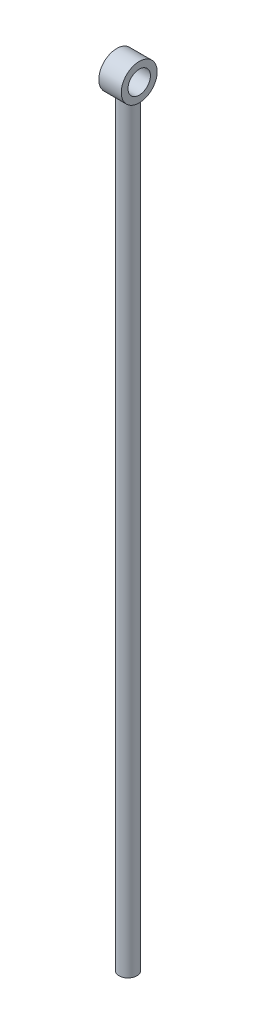
ISO-10303-21;
HEADER;
FILE_DESCRIPTION(('STEP AP214'),'2;1');
FILE_NAME('part.step','',(''),(''),'','','');
FILE_SCHEMA(('AUTOMOTIVE_DESIGN { 1 0 10303 214 1 1 1 1 }'));
ENDSEC;
DATA;
#1=APPLICATION_CONTEXT('core data for automotive mechanical design processes');
#2=APPLICATION_PROTOCOL_DEFINITION('international standard','automotive_design',2000,#1);
#3=PRODUCT_CONTEXT('',#1,'mechanical');
#4=PRODUCT('Part','Part','',(#3));
#5=PRODUCT_RELATED_PRODUCT_CATEGORY('part','',(#4));
#6=PRODUCT_DEFINITION_FORMATION('','',#4);
#7=PRODUCT_DEFINITION_CONTEXT('part definition',#1,'design');
#8=PRODUCT_DEFINITION('design','',#6,#7);
#9=PRODUCT_DEFINITION_SHAPE('','',#8);
#10=(LENGTH_UNIT() NAMED_UNIT(*) SI_UNIT(.MILLI.,.METRE.));
#11=(NAMED_UNIT(*) PLANE_ANGLE_UNIT() SI_UNIT($,.RADIAN.));
#12=(NAMED_UNIT(*) SI_UNIT($,.STERADIAN.) SOLID_ANGLE_UNIT());
#13=UNCERTAINTY_MEASURE_WITH_UNIT(LENGTH_MEASURE(1.E-05),#10,'distance_accuracy_value','');
#14=(GEOMETRIC_REPRESENTATION_CONTEXT(3) GLOBAL_UNCERTAINTY_ASSIGNED_CONTEXT((#13)) GLOBAL_UNIT_ASSIGNED_CONTEXT((#10,
#11,#12)) REPRESENTATION_CONTEXT('',''));
#15=CARTESIAN_POINT('',(0.,0.,0.));
#16=DIRECTION('',(0.,0.,1.));
#17=DIRECTION('',(1.,0.,0.));
#18=AXIS2_PLACEMENT_3D('',#15,#16,#17);
#19=CARTESIAN_POINT('',(3.175,0.,0.));
#20=DIRECTION('',(1.,0.,0.));
#21=DIRECTION('',(0.,0.,-1.));
#22=AXIS2_PLACEMENT_3D('',#19,#20,#21);
#23=PLANE('',#22);
#24=CARTESIAN_POINT('',(3.175,0.,0.));
#25=DIRECTION('',(1.,0.,0.));
#26=DIRECTION('',(0.,0.,-1.));
#27=AXIS2_PLACEMENT_3D('',#24,#25,#26);
#28=CIRCLE('',#27,5.08);
#29=CARTESIAN_POINT('',(3.175,0.,-5.08));
#30=VERTEX_POINT('',#29);
#31=EDGE_CURVE('E10',#30,#30,#28,.T.);
#32=ORIENTED_EDGE('',*,*,#31,.T.);
#33=EDGE_LOOP('',(#32));
#34=FACE_BOUND('',#33,.T.);
#35=CARTESIAN_POINT('',(3.175,0.,0.));
#36=DIRECTION('',(1.,0.,0.));
#37=DIRECTION('',(0.,0.,-1.));
#38=AXIS2_PLACEMENT_3D('',#35,#36,#37);
#39=CIRCLE('',#38,3.175);
#40=CARTESIAN_POINT('',(3.175,0.,-3.175));
#41=VERTEX_POINT('',#40);
#42=EDGE_CURVE('E48',#41,#41,#39,.T.);
#43=ORIENTED_EDGE('',*,*,#42,.F.);
#44=EDGE_LOOP('',(#43));
#45=FACE_BOUND('',#44,.T.);
#46=ADVANCED_FACE('F31',(#34,#45),#23,.T.);
#47=CARTESIAN_POINT('',(-3.175,0.,0.));
#48=DIRECTION('',(1.,0.,0.));
#49=DIRECTION('',(0.,0.,-1.));
#50=AXIS2_PLACEMENT_3D('',#47,#48,#49);
#51=PLANE('',#50);
#52=CARTESIAN_POINT('',(-3.175,0.,0.));
#53=DIRECTION('',(1.,0.,0.));
#54=DIRECTION('',(0.,0.,-1.));
#55=AXIS2_PLACEMENT_3D('',#52,#53,#54);
#56=CIRCLE('',#55,5.08);
#57=CARTESIAN_POINT('',(-3.175,0.,-5.08));
#58=VERTEX_POINT('',#57);
#59=EDGE_CURVE('E43',#58,#58,#56,.T.);
#60=ORIENTED_EDGE('',*,*,#59,.F.);
#61=EDGE_LOOP('',(#60));
#62=FACE_BOUND('',#61,.T.);
#63=CARTESIAN_POINT('',(-3.175,0.,0.));
#64=DIRECTION('',(1.,0.,0.));
#65=DIRECTION('',(0.,0.,-1.));
#66=AXIS2_PLACEMENT_3D('',#63,#64,#65);
#67=CIRCLE('',#66,3.175);
#68=CARTESIAN_POINT('',(-3.175,0.,-3.175));
#69=VERTEX_POINT('',#68);
#70=EDGE_CURVE('E50',#69,#69,#67,.T.);
#71=ORIENTED_EDGE('',*,*,#70,.T.);
#72=EDGE_LOOP('',(#71));
#73=FACE_BOUND('',#72,.T.);
#74=ADVANCED_FACE('F78',(#62,#73),#51,.F.);
#75=CARTESIAN_POINT('',(3.175,0.,0.));
#76=DIRECTION('',(-1.,0.,0.));
#77=DIRECTION('',(0.,0.,1.));
#78=AXIS2_PLACEMENT_3D('',#75,#76,#77);
#79=CYLINDRICAL_SURFACE('',#78,5.08);
#80=CARTESIAN_POINT('',(0.,-4.39940905122495,2.54));
#81=CARTESIAN_POINT('',(0.132350770986516,-4.39942205989359,2.53998931611415));
#82=CARTESIAN_POINT('',(0.264873964207068,-4.40547294637032,2.52958553785379));
#83=CARTESIAN_POINT('',(0.525850075073699,-4.42880371084738,2.48849734176543));
#84=CARTESIAN_POINT('',(0.654293844122206,-4.44610718321639,2.45777030791457));
#85=CARTESIAN_POINT('',(0.902847008690043,-4.48943350901605,2.37769376629531));
#86=CARTESIAN_POINT('',(1.0229967587392,-4.51540993120344,2.32844325135882));
#87=CARTESIAN_POINT('',(1.25329753210406,-4.57308365657239,2.21301954201317));
#88=CARTESIAN_POINT('',(1.36344801406452,-4.60478126921897,2.14684543210874));
#89=CARTESIAN_POINT('',(1.58065653277959,-4.67352048301249,1.99305300466329));
#90=CARTESIAN_POINT('',(1.6867101998416,-4.71078721880883,1.90411616957988));
#91=CARTESIAN_POINT('',(1.88317731132461,-4.78464836035092,1.71006467356716));
#92=CARTESIAN_POINT('',(1.97358295427903,-4.82124242264972,1.60494199210148));
#93=CARTESIAN_POINT('',(2.14215256250941,-4.89258551531369,1.37284349041707));
#94=CARTESIAN_POINT('',(2.21908056998761,-4.92704390321097,1.24487225991669));
#95=CARTESIAN_POINT('',(2.3498577676196,-4.98730920473876,0.975758847737885));
#96=CARTESIAN_POINT('',(2.40372152268551,-5.01312157601807,0.834625046916222));
#97=CARTESIAN_POINT('',(2.48286183961459,-5.05156371564911,0.553834157529898));
#98=CARTESIAN_POINT('',(2.50989979691897,-5.0650007976228,0.414786547830358));
#99=CARTESIAN_POINT('',(2.54042194145867,-5.08019262967796,0.133529396903767));
#100=CARTESIAN_POINT('',(2.54392038026728,-5.08195444832547,-0.00867817884021334));
#101=CARTESIAN_POINT('',(2.52794344810967,-5.07397974068068,-0.278974612038957));
#102=CARTESIAN_POINT('',(2.51043944057458,-5.06522979566164,-0.407215845909756));
#103=CARTESIAN_POINT('',(2.45648265648368,-5.03870582959682,-0.658656980671832));
#104=CARTESIAN_POINT('',(2.4200284620008,-5.0209311332862,-0.78185650357838));
#105=CARTESIAN_POINT('',(2.32897028213146,-4.97767821550663,-1.02186585458686));
#106=CARTESIAN_POINT('',(2.27412216454284,-4.95209681484171,-1.1385636957286));
#107=CARTESIAN_POINT('',(2.14817092284832,-4.8955362080618,-1.3613810758438));
#108=CARTESIAN_POINT('',(2.07706197921206,-4.86455507040008,-1.46749680805015));
#109=CARTESIAN_POINT('',(1.91288580710611,-4.79664761774044,-1.67684109868143));
#110=CARTESIAN_POINT('',(1.81837830805193,-4.75943615035365,-1.77884855057458));
#111=CARTESIAN_POINT('',(1.61394209867736,-4.68514025090501,-1.96622510055636));
#112=CARTESIAN_POINT('',(1.50400163442388,-4.64805593794697,-2.05158139739855));
#113=CARTESIAN_POINT('',(1.26327359124282,-4.57566156474911,-2.20854354999122));
#114=CARTESIAN_POINT('',(1.1316055014423,-4.54061372776397,-2.27893198004425));
#115=CARTESIAN_POINT('',(0.856138314748144,-4.47993643707583,-2.39603054702313));
#116=CARTESIAN_POINT('',(0.71235206013539,-4.45429716317011,-2.44276539185566));
#117=CARTESIAN_POINT('',(0.428715141341713,-4.41819374975267,-2.5074377360036));
#118=CARTESIAN_POINT('',(0.289455557629385,-4.40668805855181,-2.52736381018474));
#119=CARTESIAN_POINT('',(0.00914059254797551,-4.39719515178488,-2.54385304439302));
#120=CARTESIAN_POINT('',(-0.131913449964288,-4.39919838698852,-2.54043270758017));
#121=CARTESIAN_POINT('',(-0.395360953189945,-4.41539214813086,-2.51215155009367));
#122=CARTESIAN_POINT('',(-0.518107805814045,-4.42822552266901,-2.48967705444965));
#123=CARTESIAN_POINT('',(-0.757854177128324,-4.46262814740406,-2.42746856296641));
#124=CARTESIAN_POINT('',(-0.874851820896721,-4.48420022652786,-2.38772897770403));
#125=CARTESIAN_POINT('',(-1.1059447804925,-4.53482004082328,-2.29018487505636));
#126=CARTESIAN_POINT('',(-1.21965470280668,-4.5641677383738,-2.23162892177933));
#127=CARTESIAN_POINT('',(-1.43629194971038,-4.62676543523015,-2.09876914260033));
#128=CARTESIAN_POINT('',(-1.53921369452875,-4.66001743522078,-2.02445722700453));
#129=CARTESIAN_POINT('',(-1.74492606950417,-4.7317151607909,-1.8512464046843));
#130=CARTESIAN_POINT('',(-1.84606476280058,-4.77028721211879,-1.75042899167689));
#131=CARTESIAN_POINT('',(-2.03050708452601,-4.84464956843862,-1.53264741831478));
#132=CARTESIAN_POINT('',(-2.11380468846908,-4.88043893119639,-1.41567782563628));
#133=CARTESIAN_POINT('',(-2.26205726382754,-4.94643058694972,-1.16467982088723));
#134=CARTESIAN_POINT('',(-2.32647011993179,-4.97646049846733,-1.03028266779287));
#135=CARTESIAN_POINT('',(-2.43113027612141,-5.02623721596846,-0.750626806233689));
#136=CARTESIAN_POINT('',(-2.4713987956788,-5.04599304938814,-0.605377761705419));
#137=CARTESIAN_POINT('',(-2.52315615190612,-5.07155470781231,-0.322528392965501));
#138=CARTESIAN_POINT('',(-2.53694660080363,-5.07847416884123,-0.185449066830742));
#139=CARTESIAN_POINT('',(-2.54214189817451,-5.08107011155515,0.0892200037668297));
#140=CARTESIAN_POINT('',(-2.53355458303166,-5.07675052899874,0.226809552706649));
#141=CARTESIAN_POINT('',(-2.49576231311817,-5.05800280839007,0.48904650239381));
#142=CARTESIAN_POINT('',(-2.4679532336175,-5.04425952422996,0.61394929414292));
#143=CARTESIAN_POINT('',(-2.39438947104553,-5.00867917938799,0.857112711643085));
#144=CARTESIAN_POINT('',(-2.34863221445223,-4.98684095802806,0.975372382080608));
#145=CARTESIAN_POINT('',(-2.23843309616091,-4.93587863969352,1.20757547866786));
#146=CARTESIAN_POINT('',(-2.17327579091512,-4.90648287186912,1.32111796446808));
#147=CARTESIAN_POINT('',(-2.02702758409005,-4.84347858678505,1.53612748815071));
#148=CARTESIAN_POINT('',(-1.9459293642911,-4.8098681372077,1.63758894534284));
#149=CARTESIAN_POINT('',(-1.76073227283945,-4.7378266792774,1.83620199001559));
#150=CARTESIAN_POINT('',(-1.65514759038326,-4.699248814929,1.93191975666587));
#151=CARTESIAN_POINT('',(-1.42888687005165,-4.624402214575,2.10480311060383));
#152=CARTESIAN_POINT('',(-1.30819762317358,-4.58813554213154,2.18195228481965));
#153=CARTESIAN_POINT('',(-1.04989770445311,-4.52118966549109,2.31758127690365));
#154=CARTESIAN_POINT('',(-0.911872813360602,-4.49072325472536,2.37539406025089));
#155=CARTESIAN_POINT('',(-0.697765788087909,-4.45384197022655,2.44342830470546));
#156=CARTESIAN_POINT('',(-0.625287267891228,-4.44302374432391,2.46298296006935));
#157=CARTESIAN_POINT('',(-0.478494652001076,-4.4247569535767,2.49565248651881));
#158=CARTESIAN_POINT('',(-0.404181877990313,-4.41730603307902,2.50877186006043));
#159=CARTESIAN_POINT('',(-0.274826997668309,-4.40764960015607,2.52568624860646));
#160=CARTESIAN_POINT('',(-0.220049017343598,-4.40456814817188,2.5310476681887));
#161=CARTESIAN_POINT('',(-0.110190669828626,-4.40044509709904,2.53820688744636));
#162=CARTESIAN_POINT('',(-0.0551102826564787,-4.39940363447217,2.54000444872338));
#163=CARTESIAN_POINT('',(0.,-4.39940905122495,2.54));
#164=B_SPLINE_CURVE_WITH_KNOTS('',3,(#80,#81,#82,#83,#84,#85,#86,#87,#88,#89,#90,#91,#92,#93,
#94,#95,#96,#97,#98,#99,#100,#101,#102,#103,#104,#105,#106,#107,#108,#109,#110,#111,#112,#113,
#114,#115,#116,#117,#118,#119,#120,#121,#122,#123,#124,#125,#126,#127,#128,#129,#130,#131,#132,
#133,#134,#135,#136,#137,#138,#139,#140,#141,#142,#143,#144,#145,#146,#147,#148,#149,#150,#151,
#152,#153,#154,#155,#156,#157,#158,#159,#160,#161,#162,#163),.UNSPECIFIED.,.T.,.F.,(4,2,2,2,2,2,
2,2,2,2,2,2,2,2,2,2,2,2,2,2,2,2,2,2,2,2,2,2,2,2,2,2,2,2,2,2,2,2,2,2,2,4),(0.,0.396829591390577,
0.794493947775004,1.19006263366415,1.58565272268233,2.01387027379716,2.44230070559467,
2.89961046291624,3.35663100493448,3.7811325182372,4.20537700167706,4.59272887615892,
4.98010973799501,5.37285018222277,5.76573140354855,6.19575066305667,6.62609922549798,
7.08377657997964,7.54097486502895,7.96194218774863,8.38261196703632,8.75726425902189,
9.13203793192765,9.52416932876627,9.91650255004085,10.3582912869992,10.800228970498,
11.253830207941,11.7070322071944,12.1186516679446,12.5301270046185,12.9144883917876,
13.2989049112568,13.6997630683262,14.1008056846099,14.5417601430434,14.9831029483186,
15.4383930256322,15.6656272060413,15.8927021740858,16.0579292295491,16.2231673372305),.UNSPECIFIED.);
#165=CARTESIAN_POINT('',(0.,-4.39940905122495,2.54));
#166=VERTEX_POINT('',#165);
#167=EDGE_CURVE('E36',#166,#166,#164,.T.);
#168=ORIENTED_EDGE('',*,*,#167,.T.);
#169=EDGE_LOOP('',(#168));
#170=FACE_BOUND('',#169,.T.);
#171=ORIENTED_EDGE('',*,*,#31,.F.);
#172=EDGE_LOOP('',(#171));
#173=FACE_BOUND('',#172,.T.);
#174=ORIENTED_EDGE('',*,*,#59,.T.);
#175=EDGE_LOOP('',(#174));
#176=FACE_BOUND('',#175,.T.);
#177=ADVANCED_FACE('F33',(#170,#173,#176),#79,.T.);
#178=CARTESIAN_POINT('',(3.175,0.,0.));
#179=DIRECTION('',(-1.,0.,0.));
#180=DIRECTION('',(0.,0.,1.));
#181=AXIS2_PLACEMENT_3D('',#178,#179,#180);
#182=CYLINDRICAL_SURFACE('',#181,3.175);
#183=ORIENTED_EDGE('',*,*,#42,.T.);
#184=EDGE_LOOP('',(#183));
#185=FACE_BOUND('',#184,.T.);
#186=ORIENTED_EDGE('',*,*,#70,.F.);
#187=EDGE_LOOP('',(#186));
#188=FACE_BOUND('',#187,.T.);
#189=ADVANCED_FACE('F67',(#185,#188),#182,.F.);
#190=CARTESIAN_POINT('',(0.,-219.202,0.));
#191=DIRECTION('',(0.,1.,0.));
#192=DIRECTION('',(0.,0.,1.));
#193=AXIS2_PLACEMENT_3D('',#190,#191,#192);
#194=CYLINDRICAL_SURFACE('',#193,2.54);
#195=CARTESIAN_POINT('',(0.,-219.202,0.));
#196=DIRECTION('',(0.,1.,0.));
#197=DIRECTION('',(0.,0.,1.));
#198=AXIS2_PLACEMENT_3D('',#195,#196,#197);
#199=CIRCLE('',#198,2.54);
#200=CARTESIAN_POINT('',(0.,-219.202,2.54));
#201=VERTEX_POINT('',#200);
#202=EDGE_CURVE('E55',#201,#201,#199,.T.);
#203=ORIENTED_EDGE('',*,*,#202,.T.);
#204=EDGE_LOOP('',(#203));
#205=FACE_BOUND('',#204,.T.);
#206=ORIENTED_EDGE('',*,*,#167,.F.);
#207=EDGE_LOOP('',(#206));
#208=FACE_BOUND('',#207,.T.);
#209=ADVANCED_FACE('F64',(#205,#208),#194,.T.);
#210=CARTESIAN_POINT('',(0.,-219.202,0.));
#211=DIRECTION('',(0.,1.,0.));
#212=DIRECTION('',(0.,0.,1.));
#213=AXIS2_PLACEMENT_3D('',#210,#211,#212);
#214=PLANE('',#213);
#215=ORIENTED_EDGE('',*,*,#202,.F.);
#216=EDGE_LOOP('',(#215));
#217=FACE_BOUND('',#216,.T.);
#218=ADVANCED_FACE('F66',(#217),#214,.F.);
#219=CLOSED_SHELL('',(#46,#74,#177,#189,#209,#218));
#220=MANIFOLD_SOLID_BREP('B2',#219);
#221=ADVANCED_BREP_SHAPE_REPRESENTATION('',(#18,#220),#14);
#222=SHAPE_DEFINITION_REPRESENTATION(#9,#221);
ENDSEC;
END-ISO-10303-21;
